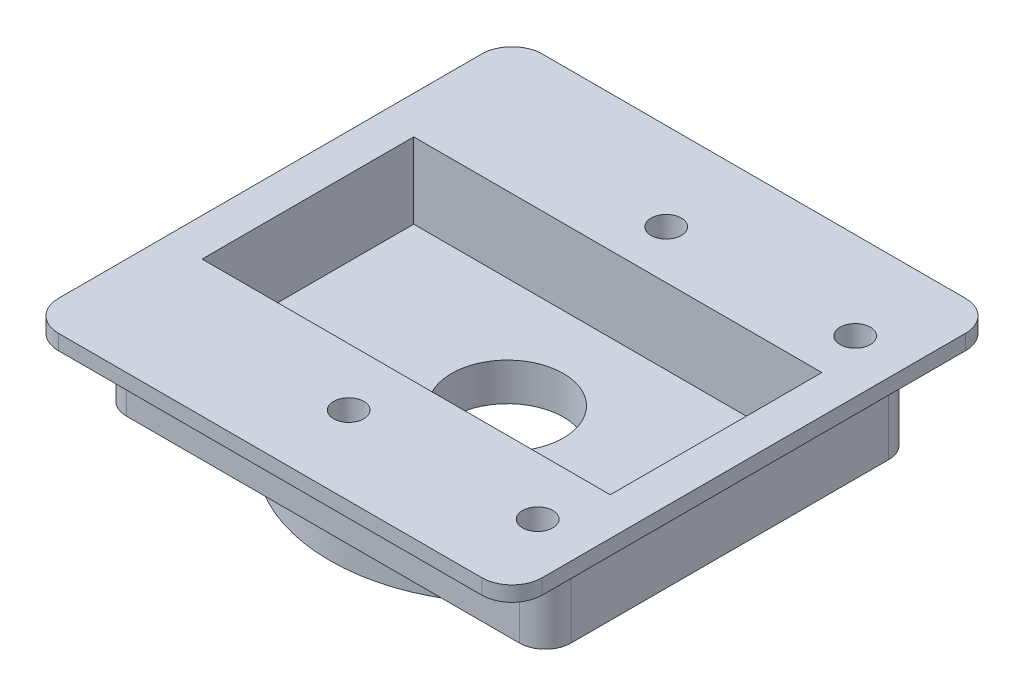
ISO-10303-21;
HEADER;
FILE_DESCRIPTION(('STEP AP214'),'2;1');
FILE_NAME('part.step','',(''),(''),'','','');
FILE_SCHEMA(('AUTOMOTIVE_DESIGN { 1 0 10303 214 1 1 1 1 }'));
ENDSEC;
DATA;
#1=APPLICATION_CONTEXT('core data for automotive mechanical design processes');
#2=APPLICATION_PROTOCOL_DEFINITION('international standard','automotive_design',2000,#1);
#3=PRODUCT_CONTEXT('',#1,'mechanical');
#4=PRODUCT('Part','Part','',(#3));
#5=PRODUCT_RELATED_PRODUCT_CATEGORY('part','',(#4));
#6=PRODUCT_DEFINITION_FORMATION('','',#4);
#7=PRODUCT_DEFINITION_CONTEXT('part definition',#1,'design');
#8=PRODUCT_DEFINITION('design','',#6,#7);
#9=PRODUCT_DEFINITION_SHAPE('','',#8);
#10=(LENGTH_UNIT() NAMED_UNIT(*) SI_UNIT(.MILLI.,.METRE.));
#11=(NAMED_UNIT(*) PLANE_ANGLE_UNIT() SI_UNIT($,.RADIAN.));
#12=(NAMED_UNIT(*) SI_UNIT($,.STERADIAN.) SOLID_ANGLE_UNIT());
#13=UNCERTAINTY_MEASURE_WITH_UNIT(LENGTH_MEASURE(1.E-05),#10,'distance_accuracy_value','');
#14=(GEOMETRIC_REPRESENTATION_CONTEXT(3) GLOBAL_UNCERTAINTY_ASSIGNED_CONTEXT((#13)) GLOBAL_UNIT_ASSIGNED_CONTEXT((#10,
#11,#12)) REPRESENTATION_CONTEXT('',''));
#15=CARTESIAN_POINT('',(0.,0.,0.));
#16=DIRECTION('',(0.,0.,1.));
#17=DIRECTION('',(1.,0.,0.));
#18=AXIS2_PLACEMENT_3D('',#15,#16,#17);
#19=CARTESIAN_POINT('',(0.,0.,0.));
#20=DIRECTION('',(0.,1.,0.));
#21=DIRECTION('',(0.,0.,1.));
#22=AXIS2_PLACEMENT_3D('',#19,#20,#21);
#23=PLANE('',#22);
#24=DIRECTION('',(0.,0.,1.));
#25=VECTOR('',#24,1.);
#26=CARTESIAN_POINT('',(-40.5526315428374,0.,2.45557808885058));
#27=LINE('',#26,#25);
#28=CARTESIAN_POINT('',(-40.5526315428374,0.,4.45557808885058));
#29=VERTEX_POINT('',#28);
#30=CARTESIAN_POINT('',(-40.5526315428374,0.,32.4555780888506));
#31=VERTEX_POINT('',#30);
#32=EDGE_CURVE('E288',#29,#31,#27,.T.);
#33=ORIENTED_EDGE('',*,*,#32,.F.);
#34=CARTESIAN_POINT('',(-38.5526315428374,0.,4.45557808885058));
#35=DIRECTION('',(0.,1.,0.));
#36=DIRECTION('',(0.,0.,1.));
#37=AXIS2_PLACEMENT_3D('',#34,#35,#36);
#38=CIRCLE('',#37,2.);
#39=CARTESIAN_POINT('',(-38.5526315428374,0.,2.45557808885058));
#40=VERTEX_POINT('',#39);
#41=EDGE_CURVE('E325',#29,#40,#38,.F.);
#42=ORIENTED_EDGE('',*,*,#41,.T.);
#43=DIRECTION('',(-1.,0.,0.));
#44=VECTOR('',#43,1.);
#45=CARTESIAN_POINT('',(-40.5526315428374,0.,2.45557808885058));
#46=LINE('',#45,#44);
#47=CARTESIAN_POINT('',(-10.5526315428374,0.,2.45557808885058));
#48=VERTEX_POINT('',#47);
#49=EDGE_CURVE('E293',#48,#40,#46,.T.);
#50=ORIENTED_EDGE('',*,*,#49,.F.);
#51=CARTESIAN_POINT('',(-10.5526315428374,0.,4.45557808885058));
#52=DIRECTION('',(0.,1.,0.));
#53=DIRECTION('',(0.,0.,1.));
#54=AXIS2_PLACEMENT_3D('',#51,#52,#53);
#55=CIRCLE('',#54,2.);
#56=CARTESIAN_POINT('',(-8.55263154283741,0.,4.45557808885058));
#57=VERTEX_POINT('',#56);
#58=EDGE_CURVE('E323',#48,#57,#55,.F.);
#59=ORIENTED_EDGE('',*,*,#58,.T.);
#60=DIRECTION('',(0.,0.,-1.));
#61=VECTOR('',#60,1.);
#62=CARTESIAN_POINT('',(-8.55263154283741,0.,2.45557808885058));
#63=LINE('',#62,#61);
#64=CARTESIAN_POINT('',(-8.55263154283741,0.,32.4555780888506));
#65=VERTEX_POINT('',#64);
#66=EDGE_CURVE('E305',#65,#57,#63,.T.);
#67=ORIENTED_EDGE('',*,*,#66,.F.);
#68=CARTESIAN_POINT('',(-10.5526315428374,0.,32.4555780888506));
#69=DIRECTION('',(0.,1.,0.));
#70=DIRECTION('',(0.,0.,1.));
#71=AXIS2_PLACEMENT_3D('',#68,#69,#70);
#72=CIRCLE('',#71,2.);
#73=CARTESIAN_POINT('',(-10.5526315428374,0.,34.4555780888506));
#74=VERTEX_POINT('',#73);
#75=EDGE_CURVE('E319',#65,#74,#72,.F.);
#76=ORIENTED_EDGE('',*,*,#75,.T.);
#77=DIRECTION('',(1.,0.,0.));
#78=VECTOR('',#77,1.);
#79=CARTESIAN_POINT('',(-40.5526315428374,0.,34.4555780888506));
#80=LINE('',#79,#78);
#81=CARTESIAN_POINT('',(-38.5526315428374,0.,34.4555780888506));
#82=VERTEX_POINT('',#81);
#83=EDGE_CURVE('E302',#82,#74,#80,.T.);
#84=ORIENTED_EDGE('',*,*,#83,.F.);
#85=CARTESIAN_POINT('',(-38.5526315428374,0.,32.4555780888506));
#86=DIRECTION('',(0.,1.,0.));
#87=DIRECTION('',(0.,0.,1.));
#88=AXIS2_PLACEMENT_3D('',#85,#86,#87);
#89=CIRCLE('',#88,2.);
#90=EDGE_CURVE('E321',#82,#31,#89,.F.);
#91=ORIENTED_EDGE('',*,*,#90,.T.);
#92=EDGE_LOOP('',(#33,#42,#50,#59,#67,#76,#84,#91));
#93=FACE_BOUND('',#92,.T.);
#94=CARTESIAN_POINT('',(-11.5526315428374,0.,29.2555780888506));
#95=DIRECTION('',(0.,-1.,0.));
#96=DIRECTION('',(0.,0.,-1.));
#97=AXIS2_PLACEMENT_3D('',#94,#95,#96);
#98=CIRCLE('',#97,1.7);
#99=CARTESIAN_POINT('',(-9.8526315428374,0.,29.2555780888506));
#100=VERTEX_POINT('',#99);
#101=CARTESIAN_POINT('',(-11.5526315428374,0.,30.9555780888506));
#102=VERTEX_POINT('',#101);
#103=EDGE_CURVE('E220',#100,#102,#98,.T.);
#104=ORIENTED_EDGE('',*,*,#103,.F.);
#105=DIRECTION('',(0.,0.,1.));
#106=VECTOR('',#105,1.);
#107=CARTESIAN_POINT('',(-9.85263154283739,0.,8.25557808885058));
#108=LINE('',#107,#106);
#109=CARTESIAN_POINT('',(-9.85263154283739,0.,8.25557808885058));
#110=VERTEX_POINT('',#109);
#111=EDGE_CURVE('E228',#110,#100,#108,.T.);
#112=ORIENTED_EDGE('',*,*,#111,.F.);
#113=CARTESIAN_POINT('',(-11.5526315428374,0.,8.25557808885058));
#114=DIRECTION('',(0.,-1.,0.));
#115=DIRECTION('',(0.,0.,-1.));
#116=AXIS2_PLACEMENT_3D('',#113,#114,#115);
#117=CIRCLE('',#116,1.7);
#118=CARTESIAN_POINT('',(-11.5526315428374,0.,6.55557808885058));
#119=VERTEX_POINT('',#118);
#120=EDGE_CURVE('E260',#119,#110,#117,.T.);
#121=ORIENTED_EDGE('',*,*,#120,.F.);
#122=DIRECTION('',(1.,0.,0.));
#123=VECTOR('',#122,1.);
#124=CARTESIAN_POINT('',(-37.5526315428374,0.,6.55557808885057));
#125=LINE('',#124,#123);
#126=CARTESIAN_POINT('',(-37.5526315428374,0.,6.55557808885057));
#127=VERTEX_POINT('',#126);
#128=EDGE_CURVE('E257',#127,#119,#125,.T.);
#129=ORIENTED_EDGE('',*,*,#128,.F.);
#130=CARTESIAN_POINT('',(-37.5526315428374,0.,8.25557808885058));
#131=DIRECTION('',(0.,-1.,0.));
#132=DIRECTION('',(0.,0.,-1.));
#133=AXIS2_PLACEMENT_3D('',#130,#131,#132);
#134=CIRCLE('',#133,1.7);
#135=CARTESIAN_POINT('',(-39.2526315428374,0.,8.25557808885058));
#136=VERTEX_POINT('',#135);
#137=EDGE_CURVE('E254',#136,#127,#134,.T.);
#138=ORIENTED_EDGE('',*,*,#137,.F.);
#139=DIRECTION('',(0.,0.,-1.));
#140=VECTOR('',#139,1.);
#141=CARTESIAN_POINT('',(-39.2526315428374,0.,29.2555780888506));
#142=LINE('',#141,#140);
#143=CARTESIAN_POINT('',(-39.2526315428374,0.,29.2555780888506));
#144=VERTEX_POINT('',#143);
#145=EDGE_CURVE('E251',#144,#136,#142,.T.);
#146=ORIENTED_EDGE('',*,*,#145,.F.);
#147=CARTESIAN_POINT('',(-37.5526315428374,0.,29.2555780888506));
#148=DIRECTION('',(0.,-1.,0.));
#149=DIRECTION('',(0.,0.,-1.));
#150=AXIS2_PLACEMENT_3D('',#147,#148,#149);
#151=CIRCLE('',#150,1.7);
#152=CARTESIAN_POINT('',(-37.5526315428374,0.,30.9555780888506));
#153=VERTEX_POINT('',#152);
#154=EDGE_CURVE('E248',#153,#144,#151,.T.);
#155=ORIENTED_EDGE('',*,*,#154,.F.);
#156=DIRECTION('',(-1.,0.,0.));
#157=VECTOR('',#156,1.);
#158=CARTESIAN_POINT('',(-11.5526315428374,0.,30.9555780888506));
#159=LINE('',#158,#157);
#160=EDGE_CURVE('E245',#102,#153,#159,.T.);
#161=ORIENTED_EDGE('',*,*,#160,.F.);
#162=EDGE_LOOP('',(#104,#112,#121,#129,#138,#146,#155,#161));
#163=FACE_BOUND('',#162,.T.);
#164=ADVANCED_FACE('F38',(#93,#163),#23,.F.);
#165=CARTESIAN_POINT('',(-40.5526315428374,1.,2.45557808885058));
#166=DIRECTION('',(1.,0.,0.));
#167=DIRECTION('',(0.,0.,-1.));
#168=AXIS2_PLACEMENT_3D('',#165,#166,#167);
#169=PLANE('',#168);
#170=DIRECTION('',(0.,0.,1.));
#171=VECTOR('',#170,1.);
#172=CARTESIAN_POINT('',(-40.5526315428374,1.,2.45557808885058));
#173=LINE('',#172,#171);
#174=CARTESIAN_POINT('',(-40.5526315428374,1.,4.45557808885058));
#175=VERTEX_POINT('',#174);
#176=CARTESIAN_POINT('',(-40.5526315428374,1.,32.4555780888506));
#177=VERTEX_POINT('',#176);
#178=EDGE_CURVE('E289',#175,#177,#173,.T.);
#179=ORIENTED_EDGE('',*,*,#178,.F.);
#180=DIRECTION('',(0.,-1.,0.));
#181=VECTOR('',#180,1.);
#182=CARTESIAN_POINT('',(-40.5526315428374,1.,4.45557808885058));
#183=LINE('',#182,#181);
#184=EDGE_CURVE('E316',#175,#29,#183,.T.);
#185=ORIENTED_EDGE('',*,*,#184,.T.);
#186=ORIENTED_EDGE('',*,*,#32,.T.);
#187=DIRECTION('',(0.,-1.,0.));
#188=VECTOR('',#187,1.);
#189=CARTESIAN_POINT('',(-40.5526315428374,1.,32.4555780888506));
#190=LINE('',#189,#188);
#191=EDGE_CURVE('E314',#31,#177,#190,.F.);
#192=ORIENTED_EDGE('',*,*,#191,.T.);
#193=EDGE_LOOP('',(#179,#185,#186,#192));
#194=FACE_BOUND('',#193,.T.);
#195=ADVANCED_FACE('F372',(#194),#169,.F.);
#196=CARTESIAN_POINT('',(-40.5526315428374,1.,34.4555780888506));
#197=DIRECTION('',(0.,0.,-1.));
#198=DIRECTION('',(-1.,0.,0.));
#199=AXIS2_PLACEMENT_3D('',#196,#197,#198);
#200=PLANE('',#199);
#201=DIRECTION('',(1.,0.,0.));
#202=VECTOR('',#201,1.);
#203=CARTESIAN_POINT('',(-40.5526315428374,1.,34.4555780888506));
#204=LINE('',#203,#202);
#205=CARTESIAN_POINT('',(-38.5526315428374,1.,34.4555780888506));
#206=VERTEX_POINT('',#205);
#207=CARTESIAN_POINT('',(-10.5526315428374,1.,34.4555780888506));
#208=VERTEX_POINT('',#207);
#209=EDGE_CURVE('E292',#206,#208,#204,.T.);
#210=ORIENTED_EDGE('',*,*,#209,.F.);
#211=DIRECTION('',(0.,-1.,0.));
#212=VECTOR('',#211,1.);
#213=CARTESIAN_POINT('',(-38.5526315428374,1.,34.4555780888506));
#214=LINE('',#213,#212);
#215=EDGE_CURVE('E11',#206,#82,#214,.T.);
#216=ORIENTED_EDGE('',*,*,#215,.T.);
#217=ORIENTED_EDGE('',*,*,#83,.T.);
#218=DIRECTION('',(0.,-1.,0.));
#219=VECTOR('',#218,1.);
#220=CARTESIAN_POINT('',(-10.5526315428374,1.,34.4555780888506));
#221=LINE('',#220,#219);
#222=EDGE_CURVE('E46',#74,#208,#221,.F.);
#223=ORIENTED_EDGE('',*,*,#222,.T.);
#224=EDGE_LOOP('',(#210,#216,#217,#223));
#225=FACE_BOUND('',#224,.T.);
#226=ADVANCED_FACE('F345',(#225),#200,.F.);
#227=CARTESIAN_POINT('',(-8.55263154283741,1.,2.45557808885058));
#228=DIRECTION('',(-1.,0.,0.));
#229=DIRECTION('',(0.,0.,1.));
#230=AXIS2_PLACEMENT_3D('',#227,#228,#229);
#231=PLANE('',#230);
#232=ORIENTED_EDGE('',*,*,#66,.T.);
#233=DIRECTION('',(0.,-1.,0.));
#234=VECTOR('',#233,1.);
#235=CARTESIAN_POINT('',(-8.55263154283741,1.,4.45557808885058));
#236=LINE('',#235,#234);
#237=CARTESIAN_POINT('',(-8.55263154283741,1.,4.45557808885058));
#238=VERTEX_POINT('',#237);
#239=EDGE_CURVE('E53',#57,#238,#236,.F.);
#240=ORIENTED_EDGE('',*,*,#239,.T.);
#241=DIRECTION('',(0.,0.,-1.));
#242=VECTOR('',#241,1.);
#243=CARTESIAN_POINT('',(-8.55263154283741,1.,2.45557808885058));
#244=LINE('',#243,#242);
#245=CARTESIAN_POINT('',(-8.55263154283741,1.,32.4555780888506));
#246=VERTEX_POINT('',#245);
#247=EDGE_CURVE('E295',#246,#238,#244,.T.);
#248=ORIENTED_EDGE('',*,*,#247,.F.);
#249=DIRECTION('',(0.,-1.,0.));
#250=VECTOR('',#249,1.);
#251=CARTESIAN_POINT('',(-8.55263154283741,1.,32.4555780888506));
#252=LINE('',#251,#250);
#253=EDGE_CURVE('E339',#246,#65,#252,.T.);
#254=ORIENTED_EDGE('',*,*,#253,.T.);
#255=EDGE_LOOP('',(#232,#240,#248,#254));
#256=FACE_BOUND('',#255,.T.);
#257=ADVANCED_FACE('F353',(#256),#231,.F.);
#258=CARTESIAN_POINT('',(-40.5526315428374,1.,2.45557808885058));
#259=DIRECTION('',(0.,0.,1.));
#260=DIRECTION('',(1.,0.,0.));
#261=AXIS2_PLACEMENT_3D('',#258,#259,#260);
#262=PLANE('',#261);
#263=ORIENTED_EDGE('',*,*,#49,.T.);
#264=DIRECTION('',(0.,-1.,0.));
#265=VECTOR('',#264,1.);
#266=CARTESIAN_POINT('',(-38.5526315428374,1.,2.45557808885058));
#267=LINE('',#266,#265);
#268=CARTESIAN_POINT('',(-38.5526315428374,1.,2.45557808885058));
#269=VERTEX_POINT('',#268);
#270=EDGE_CURVE('E330',#40,#269,#267,.F.);
#271=ORIENTED_EDGE('',*,*,#270,.T.);
#272=DIRECTION('',(-1.,0.,0.));
#273=VECTOR('',#272,1.);
#274=CARTESIAN_POINT('',(-40.5526315428374,1.,2.45557808885058));
#275=LINE('',#274,#273);
#276=CARTESIAN_POINT('',(-10.5526315428374,1.,2.45557808885058));
#277=VERTEX_POINT('',#276);
#278=EDGE_CURVE('E297',#277,#269,#275,.T.);
#279=ORIENTED_EDGE('',*,*,#278,.F.);
#280=DIRECTION('',(0.,-1.,0.));
#281=VECTOR('',#280,1.);
#282=CARTESIAN_POINT('',(-10.5526315428374,1.,2.45557808885058));
#283=LINE('',#282,#281);
#284=EDGE_CURVE('E327',#277,#48,#283,.T.);
#285=ORIENTED_EDGE('',*,*,#284,.T.);
#286=EDGE_LOOP('',(#263,#271,#279,#285));
#287=FACE_BOUND('',#286,.T.);
#288=ADVANCED_FACE('F364',(#287),#262,.F.);
#289=CARTESIAN_POINT('',(0.,1.,0.));
#290=DIRECTION('',(0.,1.,0.));
#291=DIRECTION('',(0.,0.,1.));
#292=AXIS2_PLACEMENT_3D('',#289,#290,#291);
#293=PLANE('',#292);
#294=CARTESIAN_POINT('',(-12.0526315428374,1.,8.25557808885049));
#295=DIRECTION('',(0.,1.,0.));
#296=DIRECTION('',(0.,0.,1.));
#297=AXIS2_PLACEMENT_3D('',#294,#295,#296);
#298=CIRCLE('',#297,1.);
#299=CARTESIAN_POINT('',(-12.0526315428374,1.,9.25557808885049));
#300=VERTEX_POINT('',#299);
#301=EDGE_CURVE('E505',#300,#300,#298,.T.);
#302=ORIENTED_EDGE('',*,*,#301,.F.);
#303=EDGE_LOOP('',(#302));
#304=FACE_BOUND('',#303,.T.);
#305=CARTESIAN_POINT('',(-24.5526315428373,1.,29.2555780888506));
#306=DIRECTION('',(0.,1.,0.));
#307=DIRECTION('',(0.,0.,1.));
#308=AXIS2_PLACEMENT_3D('',#305,#306,#307);
#309=CIRCLE('',#308,1.);
#310=CARTESIAN_POINT('',(-24.5526315428373,1.,30.2555780888506));
#311=VERTEX_POINT('',#310);
#312=EDGE_CURVE('E509',#311,#311,#309,.T.);
#313=ORIENTED_EDGE('',*,*,#312,.F.);
#314=EDGE_LOOP('',(#313));
#315=FACE_BOUND('',#314,.T.);
#316=CARTESIAN_POINT('',(-12.0526315428373,1.,29.2555780888505));
#317=DIRECTION('',(0.,1.,0.));
#318=DIRECTION('',(0.,0.,1.));
#319=AXIS2_PLACEMENT_3D('',#316,#317,#318);
#320=CIRCLE('',#319,1.);
#321=CARTESIAN_POINT('',(-12.0526315428373,1.,30.2555780888505));
#322=VERTEX_POINT('',#321);
#323=EDGE_CURVE('E513',#322,#322,#320,.T.);
#324=ORIENTED_EDGE('',*,*,#323,.F.);
#325=EDGE_LOOP('',(#324));
#326=FACE_BOUND('',#325,.T.);
#327=CARTESIAN_POINT('',(-24.5526315428374,1.,8.25557808885058));
#328=DIRECTION('',(0.,1.,0.));
#329=DIRECTION('',(0.,0.,1.));
#330=AXIS2_PLACEMENT_3D('',#327,#328,#329);
#331=CIRCLE('',#330,1.);
#332=CARTESIAN_POINT('',(-24.5526315428374,1.,9.25557808885058));
#333=VERTEX_POINT('',#332);
#334=EDGE_CURVE('E517',#333,#333,#331,.T.);
#335=ORIENTED_EDGE('',*,*,#334,.F.);
#336=EDGE_LOOP('',(#335));
#337=FACE_BOUND('',#336,.T.);
#338=DIRECTION('',(0.,0.,-1.));
#339=VECTOR('',#338,1.);
#340=CARTESIAN_POINT('',(-11.0526315428374,1.,11.4555780888506));
#341=LINE('',#340,#339);
#342=CARTESIAN_POINT('',(-11.0526315428374,1.,25.4555780888506));
#343=VERTEX_POINT('',#342);
#344=CARTESIAN_POINT('',(-11.0526315428374,1.,11.4555780888506));
#345=VERTEX_POINT('',#344);
#346=EDGE_CURVE('E184',#343,#345,#341,.T.);
#347=ORIENTED_EDGE('',*,*,#346,.F.);
#348=DIRECTION('',(1.,0.,0.));
#349=VECTOR('',#348,1.);
#350=CARTESIAN_POINT('',(-11.0526315428374,1.,25.4555780888506));
#351=LINE('',#350,#349);
#352=CARTESIAN_POINT('',(-38.0526315428374,1.,25.4555780888506));
#353=VERTEX_POINT('',#352);
#354=EDGE_CURVE('E201',#353,#343,#351,.T.);
#355=ORIENTED_EDGE('',*,*,#354,.F.);
#356=DIRECTION('',(0.,0.,1.));
#357=VECTOR('',#356,1.);
#358=CARTESIAN_POINT('',(-38.0526315428374,1.,11.4555780888506));
#359=LINE('',#358,#357);
#360=CARTESIAN_POINT('',(-38.0526315428374,1.,11.4555780888506));
#361=VERTEX_POINT('',#360);
#362=EDGE_CURVE('E204',#361,#353,#359,.T.);
#363=ORIENTED_EDGE('',*,*,#362,.F.);
#364=DIRECTION('',(-1.,0.,0.));
#365=VECTOR('',#364,1.);
#366=CARTESIAN_POINT('',(-11.0526315428374,1.,11.4555780888506));
#367=LINE('',#366,#365);
#368=EDGE_CURVE('E213',#345,#361,#367,.T.);
#369=ORIENTED_EDGE('',*,*,#368,.F.);
#370=EDGE_LOOP('',(#347,#355,#363,#369));
#371=FACE_BOUND('',#370,.T.);
#372=ORIENTED_EDGE('',*,*,#278,.T.);
#373=CARTESIAN_POINT('',(-38.5526315428374,1.,4.45557808885058));
#374=DIRECTION('',(0.,1.,0.));
#375=DIRECTION('',(0.,0.,1.));
#376=AXIS2_PLACEMENT_3D('',#373,#374,#375);
#377=CIRCLE('',#376,2.);
#378=EDGE_CURVE('E337',#269,#175,#377,.T.);
#379=ORIENTED_EDGE('',*,*,#378,.T.);
#380=ORIENTED_EDGE('',*,*,#178,.T.);
#381=CARTESIAN_POINT('',(-38.5526315428374,1.,32.4555780888506));
#382=DIRECTION('',(0.,1.,0.));
#383=DIRECTION('',(0.,0.,1.));
#384=AXIS2_PLACEMENT_3D('',#381,#382,#383);
#385=CIRCLE('',#384,2.);
#386=EDGE_CURVE('E333',#177,#206,#385,.T.);
#387=ORIENTED_EDGE('',*,*,#386,.T.);
#388=ORIENTED_EDGE('',*,*,#209,.T.);
#389=CARTESIAN_POINT('',(-10.5526315428374,1.,32.4555780888506));
#390=DIRECTION('',(0.,1.,0.));
#391=DIRECTION('',(0.,0.,1.));
#392=AXIS2_PLACEMENT_3D('',#389,#390,#391);
#393=CIRCLE('',#392,2.);
#394=EDGE_CURVE('E60',#208,#246,#393,.T.);
#395=ORIENTED_EDGE('',*,*,#394,.T.);
#396=ORIENTED_EDGE('',*,*,#247,.T.);
#397=CARTESIAN_POINT('',(-10.5526315428374,1.,4.45557808885058));
#398=DIRECTION('',(0.,1.,0.));
#399=DIRECTION('',(0.,0.,1.));
#400=AXIS2_PLACEMENT_3D('',#397,#398,#399);
#401=CIRCLE('',#400,2.);
#402=EDGE_CURVE('E335',#238,#277,#401,.T.);
#403=ORIENTED_EDGE('',*,*,#402,.T.);
#404=EDGE_LOOP('',(#372,#379,#380,#387,#388,#395,#396,#403));
#405=FACE_BOUND('',#404,.T.);
#406=ADVANCED_FACE('F349',(#304,#315,#326,#337,#371,#405),#293,.T.);
#407=CARTESIAN_POINT('',(-11.5526315428374,-5.,29.2555780888506));
#408=DIRECTION('',(0.,1.,0.));
#409=DIRECTION('',(0.,0.,1.));
#410=AXIS2_PLACEMENT_3D('',#407,#408,#409);
#411=CYLINDRICAL_SURFACE('',#410,1.7);
#412=ORIENTED_EDGE('',*,*,#103,.T.);
#413=DIRECTION('',(0.,1.,0.));
#414=VECTOR('',#413,1.);
#415=CARTESIAN_POINT('',(-11.5526315428374,-5.,30.9555780888506));
#416=LINE('',#415,#414);
#417=CARTESIAN_POINT('',(-11.5526315428374,-5.,30.9555780888506));
#418=VERTEX_POINT('',#417);
#419=EDGE_CURVE('E285',#418,#102,#416,.T.);
#420=ORIENTED_EDGE('',*,*,#419,.F.);
#421=CARTESIAN_POINT('',(-11.5526315428374,-5.,29.2555780888506));
#422=DIRECTION('',(0.,-1.,0.));
#423=DIRECTION('',(0.,0.,-1.));
#424=AXIS2_PLACEMENT_3D('',#421,#422,#423);
#425=CIRCLE('',#424,1.7);
#426=CARTESIAN_POINT('',(-9.8526315428374,-5.,29.2555780888506));
#427=VERTEX_POINT('',#426);
#428=EDGE_CURVE('E224',#427,#418,#425,.T.);
#429=ORIENTED_EDGE('',*,*,#428,.F.);
#430=DIRECTION('',(0.,1.,0.));
#431=VECTOR('',#430,1.);
#432=CARTESIAN_POINT('',(-9.8526315428374,-5.,29.2555780888506));
#433=LINE('',#432,#431);
#434=EDGE_CURVE('E242',#427,#100,#433,.T.);
#435=ORIENTED_EDGE('',*,*,#434,.T.);
#436=EDGE_LOOP('',(#412,#420,#429,#435));
#437=FACE_BOUND('',#436,.T.);
#438=ADVANCED_FACE('F473',(#437),#411,.T.);
#439=CARTESIAN_POINT('',(-11.5526315428374,-5.,30.9555780888506));
#440=DIRECTION('',(0.,0.,-1.));
#441=DIRECTION('',(-1.,0.,0.));
#442=AXIS2_PLACEMENT_3D('',#439,#440,#441);
#443=PLANE('',#442);
#444=ORIENTED_EDGE('',*,*,#160,.T.);
#445=DIRECTION('',(0.,1.,0.));
#446=VECTOR('',#445,1.);
#447=CARTESIAN_POINT('',(-37.5526315428374,-5.,30.9555780888506));
#448=LINE('',#447,#446);
#449=CARTESIAN_POINT('',(-37.5526315428374,-5.,30.9555780888506));
#450=VERTEX_POINT('',#449);
#451=EDGE_CURVE('E282',#450,#153,#448,.T.);
#452=ORIENTED_EDGE('',*,*,#451,.F.);
#453=DIRECTION('',(-1.,0.,0.));
#454=VECTOR('',#453,1.);
#455=CARTESIAN_POINT('',(-11.5526315428374,-5.,30.9555780888506));
#456=LINE('',#455,#454);
#457=EDGE_CURVE('E227',#418,#450,#456,.T.);
#458=ORIENTED_EDGE('',*,*,#457,.F.);
#459=ORIENTED_EDGE('',*,*,#419,.T.);
#460=EDGE_LOOP('',(#444,#452,#458,#459));
#461=FACE_BOUND('',#460,.T.);
#462=ADVANCED_FACE('F470',(#461),#443,.F.);
#463=CARTESIAN_POINT('',(-37.5526315428374,-5.,29.2555780888506));
#464=DIRECTION('',(0.,1.,0.));
#465=DIRECTION('',(0.,0.,1.));
#466=AXIS2_PLACEMENT_3D('',#463,#464,#465);
#467=CYLINDRICAL_SURFACE('',#466,1.7);
#468=ORIENTED_EDGE('',*,*,#154,.T.);
#469=DIRECTION('',(0.,1.,0.));
#470=VECTOR('',#469,1.);
#471=CARTESIAN_POINT('',(-39.2526315428374,-5.,29.2555780888506));
#472=LINE('',#471,#470);
#473=CARTESIAN_POINT('',(-39.2526315428374,-5.,29.2555780888506));
#474=VERTEX_POINT('',#473);
#475=EDGE_CURVE('E279',#474,#144,#472,.T.);
#476=ORIENTED_EDGE('',*,*,#475,.F.);
#477=CARTESIAN_POINT('',(-37.5526315428374,-5.,29.2555780888506));
#478=DIRECTION('',(0.,-1.,0.));
#479=DIRECTION('',(0.,0.,-1.));
#480=AXIS2_PLACEMENT_3D('',#477,#478,#479);
#481=CIRCLE('',#480,1.7);
#482=EDGE_CURVE('E230',#450,#474,#481,.T.);
#483=ORIENTED_EDGE('',*,*,#482,.F.);
#484=ORIENTED_EDGE('',*,*,#451,.T.);
#485=EDGE_LOOP('',(#468,#476,#483,#484));
#486=FACE_BOUND('',#485,.T.);
#487=ADVANCED_FACE('F466',(#486),#467,.T.);
#488=CARTESIAN_POINT('',(-39.2526315428374,-5.,29.2555780888506));
#489=DIRECTION('',(1.,0.,0.));
#490=DIRECTION('',(0.,0.,-1.));
#491=AXIS2_PLACEMENT_3D('',#488,#489,#490);
#492=PLANE('',#491);
#493=ORIENTED_EDGE('',*,*,#145,.T.);
#494=DIRECTION('',(0.,1.,0.));
#495=VECTOR('',#494,1.);
#496=CARTESIAN_POINT('',(-39.2526315428374,-5.,8.25557808885058));
#497=LINE('',#496,#495);
#498=CARTESIAN_POINT('',(-39.2526315428374,-5.,8.25557808885058));
#499=VERTEX_POINT('',#498);
#500=EDGE_CURVE('E276',#499,#136,#497,.T.);
#501=ORIENTED_EDGE('',*,*,#500,.F.);
#502=DIRECTION('',(0.,0.,-1.));
#503=VECTOR('',#502,1.);
#504=CARTESIAN_POINT('',(-39.2526315428374,-5.,29.2555780888506));
#505=LINE('',#504,#503);
#506=EDGE_CURVE('E232',#474,#499,#505,.T.);
#507=ORIENTED_EDGE('',*,*,#506,.F.);
#508=ORIENTED_EDGE('',*,*,#475,.T.);
#509=EDGE_LOOP('',(#493,#501,#507,#508));
#510=FACE_BOUND('',#509,.T.);
#511=ADVANCED_FACE('F462',(#510),#492,.F.);
#512=CARTESIAN_POINT('',(-37.5526315428374,-5.,8.25557808885058));
#513=DIRECTION('',(0.,1.,0.));
#514=DIRECTION('',(0.,0.,1.));
#515=AXIS2_PLACEMENT_3D('',#512,#513,#514);
#516=CYLINDRICAL_SURFACE('',#515,1.7);
#517=ORIENTED_EDGE('',*,*,#137,.T.);
#518=DIRECTION('',(0.,1.,0.));
#519=VECTOR('',#518,1.);
#520=CARTESIAN_POINT('',(-37.5526315428374,-5.,6.55557808885057));
#521=LINE('',#520,#519);
#522=CARTESIAN_POINT('',(-37.5526315428374,-5.,6.55557808885057));
#523=VERTEX_POINT('',#522);
#524=EDGE_CURVE('E273',#523,#127,#521,.T.);
#525=ORIENTED_EDGE('',*,*,#524,.F.);
#526=CARTESIAN_POINT('',(-37.5526315428374,-5.,8.25557808885058));
#527=DIRECTION('',(0.,-1.,0.));
#528=DIRECTION('',(0.,0.,-1.));
#529=AXIS2_PLACEMENT_3D('',#526,#527,#528);
#530=CIRCLE('',#529,1.7);
#531=EDGE_CURVE('E234',#499,#523,#530,.T.);
#532=ORIENTED_EDGE('',*,*,#531,.F.);
#533=ORIENTED_EDGE('',*,*,#500,.T.);
#534=EDGE_LOOP('',(#517,#525,#532,#533));
#535=FACE_BOUND('',#534,.T.);
#536=ADVANCED_FACE('F458',(#535),#516,.T.);
#537=CARTESIAN_POINT('',(-37.5526315428374,-5.,6.55557808885057));
#538=DIRECTION('',(0.,0.,1.));
#539=DIRECTION('',(1.,0.,0.));
#540=AXIS2_PLACEMENT_3D('',#537,#538,#539);
#541=PLANE('',#540);
#542=ORIENTED_EDGE('',*,*,#128,.T.);
#543=DIRECTION('',(0.,1.,0.));
#544=VECTOR('',#543,1.);
#545=CARTESIAN_POINT('',(-11.5526315428374,-5.,6.55557808885058));
#546=LINE('',#545,#544);
#547=CARTESIAN_POINT('',(-11.5526315428374,-5.,6.55557808885058));
#548=VERTEX_POINT('',#547);
#549=EDGE_CURVE('E270',#548,#119,#546,.T.);
#550=ORIENTED_EDGE('',*,*,#549,.F.);
#551=DIRECTION('',(1.,0.,0.));
#552=VECTOR('',#551,1.);
#553=CARTESIAN_POINT('',(-37.5526315428374,-5.,6.55557808885057));
#554=LINE('',#553,#552);
#555=EDGE_CURVE('E236',#523,#548,#554,.T.);
#556=ORIENTED_EDGE('',*,*,#555,.F.);
#557=ORIENTED_EDGE('',*,*,#524,.T.);
#558=EDGE_LOOP('',(#542,#550,#556,#557));
#559=FACE_BOUND('',#558,.T.);
#560=ADVANCED_FACE('F454',(#559),#541,.F.);
#561=CARTESIAN_POINT('',(-11.5526315428374,-5.,8.25557808885058));
#562=DIRECTION('',(0.,1.,0.));
#563=DIRECTION('',(0.,0.,1.));
#564=AXIS2_PLACEMENT_3D('',#561,#562,#563);
#565=CYLINDRICAL_SURFACE('',#564,1.7);
#566=ORIENTED_EDGE('',*,*,#120,.T.);
#567=DIRECTION('',(0.,1.,0.));
#568=VECTOR('',#567,1.);
#569=CARTESIAN_POINT('',(-9.85263154283739,-5.,8.25557808885058));
#570=LINE('',#569,#568);
#571=CARTESIAN_POINT('',(-9.85263154283739,-5.,8.25557808885058));
#572=VERTEX_POINT('',#571);
#573=EDGE_CURVE('E267',#572,#110,#570,.T.);
#574=ORIENTED_EDGE('',*,*,#573,.F.);
#575=CARTESIAN_POINT('',(-11.5526315428374,-5.,8.25557808885058));
#576=DIRECTION('',(0.,-1.,0.));
#577=DIRECTION('',(0.,0.,-1.));
#578=AXIS2_PLACEMENT_3D('',#575,#576,#577);
#579=CIRCLE('',#578,1.7);
#580=EDGE_CURVE('E238',#548,#572,#579,.T.);
#581=ORIENTED_EDGE('',*,*,#580,.F.);
#582=ORIENTED_EDGE('',*,*,#549,.T.);
#583=EDGE_LOOP('',(#566,#574,#581,#582));
#584=FACE_BOUND('',#583,.T.);
#585=ADVANCED_FACE('F450',(#584),#565,.T.);
#586=CARTESIAN_POINT('',(-9.85263154283739,-5.,8.25557808885058));
#587=DIRECTION('',(-1.,0.,0.));
#588=DIRECTION('',(0.,0.,1.));
#589=AXIS2_PLACEMENT_3D('',#586,#587,#588);
#590=PLANE('',#589);
#591=ORIENTED_EDGE('',*,*,#111,.T.);
#592=ORIENTED_EDGE('',*,*,#434,.F.);
#593=DIRECTION('',(0.,0.,1.));
#594=VECTOR('',#593,1.);
#595=CARTESIAN_POINT('',(-9.85263154283739,-5.,8.25557808885058));
#596=LINE('',#595,#594);
#597=EDGE_CURVE('E240',#572,#427,#596,.T.);
#598=ORIENTED_EDGE('',*,*,#597,.F.);
#599=ORIENTED_EDGE('',*,*,#573,.T.);
#600=EDGE_LOOP('',(#591,#592,#598,#599));
#601=FACE_BOUND('',#600,.T.);
#602=ADVANCED_FACE('F446',(#601),#590,.F.);
#603=CARTESIAN_POINT('',(-11.5526315428374,-5.,29.2555780888506));
#604=DIRECTION('',(0.,-1.,0.));
#605=DIRECTION('',(0.,0.,-1.));
#606=AXIS2_PLACEMENT_3D('',#603,#604,#605);
#607=PLANE('',#606);
#608=CARTESIAN_POINT('',(-24.5526315428374,-5.,18.7555780888506));
#609=DIRECTION('',(0.,-1.,0.));
#610=DIRECTION('',(0.,0.,-1.));
#611=AXIS2_PLACEMENT_3D('',#608,#609,#610);
#612=CIRCLE('',#611,11.7476249971324);
#613=CARTESIAN_POINT('',(-24.5526315428374,-5.,7.00795309171819));
#614=VERTEX_POINT('',#613);
#615=EDGE_CURVE('E207',#614,#614,#612,.T.);
#616=ORIENTED_EDGE('',*,*,#615,.F.);
#617=EDGE_LOOP('',(#616));
#618=FACE_BOUND('',#617,.T.);
#619=ORIENTED_EDGE('',*,*,#428,.T.);
#620=ORIENTED_EDGE('',*,*,#457,.T.);
#621=ORIENTED_EDGE('',*,*,#482,.T.);
#622=ORIENTED_EDGE('',*,*,#506,.T.);
#623=ORIENTED_EDGE('',*,*,#531,.T.);
#624=ORIENTED_EDGE('',*,*,#555,.T.);
#625=ORIENTED_EDGE('',*,*,#580,.T.);
#626=ORIENTED_EDGE('',*,*,#597,.T.);
#627=EDGE_LOOP('',(#619,#620,#621,#622,#623,#624,#625,#626));
#628=FACE_BOUND('',#627,.T.);
#629=ADVANCED_FACE('F443',(#618,#628),#607,.T.);
#630=CARTESIAN_POINT('',(-11.0526315428374,-4.,11.4555780888506));
#631=DIRECTION('',(1.,0.,0.));
#632=DIRECTION('',(0.,0.,-1.));
#633=AXIS2_PLACEMENT_3D('',#630,#631,#632);
#634=PLANE('',#633);
#635=ORIENTED_EDGE('',*,*,#346,.T.);
#636=DIRECTION('',(0.,1.,0.));
#637=VECTOR('',#636,1.);
#638=CARTESIAN_POINT('',(-11.0526315428374,-4.,11.4555780888506));
#639=LINE('',#638,#637);
#640=CARTESIAN_POINT('',(-11.0526315428374,-4.,11.4555780888506));
#641=VERTEX_POINT('',#640);
#642=EDGE_CURVE('E177',#641,#345,#639,.T.);
#643=ORIENTED_EDGE('',*,*,#642,.F.);
#644=DIRECTION('',(0.,0.,-1.));
#645=VECTOR('',#644,1.);
#646=CARTESIAN_POINT('',(-11.0526315428374,-4.,11.4555780888506));
#647=LINE('',#646,#645);
#648=CARTESIAN_POINT('',(-11.0526315428374,-4.,25.4555780888506));
#649=VERTEX_POINT('',#648);
#650=EDGE_CURVE('E181',#649,#641,#647,.T.);
#651=ORIENTED_EDGE('',*,*,#650,.F.);
#652=DIRECTION('',(0.,1.,0.));
#653=VECTOR('',#652,1.);
#654=CARTESIAN_POINT('',(-11.0526315428374,-4.,25.4555780888506));
#655=LINE('',#654,#653);
#656=EDGE_CURVE('E218',#649,#343,#655,.T.);
#657=ORIENTED_EDGE('',*,*,#656,.T.);
#658=EDGE_LOOP('',(#635,#643,#651,#657));
#659=FACE_BOUND('',#658,.T.);
#660=ADVANCED_FACE('F179',(#659),#634,.F.);
#661=CARTESIAN_POINT('',(-11.0526315428374,-4.,25.4555780888506));
#662=DIRECTION('',(0.,0.,1.));
#663=DIRECTION('',(1.,0.,0.));
#664=AXIS2_PLACEMENT_3D('',#661,#662,#663);
#665=PLANE('',#664);
#666=ORIENTED_EDGE('',*,*,#354,.T.);
#667=ORIENTED_EDGE('',*,*,#656,.F.);
#668=DIRECTION('',(1.,0.,0.));
#669=VECTOR('',#668,1.);
#670=CARTESIAN_POINT('',(-11.0526315428374,-4.,25.4555780888506));
#671=LINE('',#670,#669);
#672=CARTESIAN_POINT('',(-38.0526315428374,-4.,25.4555780888506));
#673=VERTEX_POINT('',#672);
#674=EDGE_CURVE('E189',#673,#649,#671,.T.);
#675=ORIENTED_EDGE('',*,*,#674,.F.);
#676=DIRECTION('',(0.,1.,0.));
#677=VECTOR('',#676,1.);
#678=CARTESIAN_POINT('',(-38.0526315428374,-4.,25.4555780888506));
#679=LINE('',#678,#677);
#680=EDGE_CURVE('E221',#673,#353,#679,.T.);
#681=ORIENTED_EDGE('',*,*,#680,.T.);
#682=EDGE_LOOP('',(#666,#667,#675,#681));
#683=FACE_BOUND('',#682,.T.);
#684=ADVANCED_FACE('F431',(#683),#665,.F.);
#685=CARTESIAN_POINT('',(-38.0526315428374,-4.,11.4555780888506));
#686=DIRECTION('',(-1.,0.,0.));
#687=DIRECTION('',(0.,0.,1.));
#688=AXIS2_PLACEMENT_3D('',#685,#686,#687);
#689=PLANE('',#688);
#690=ORIENTED_EDGE('',*,*,#362,.T.);
#691=ORIENTED_EDGE('',*,*,#680,.F.);
#692=DIRECTION('',(0.,0.,1.));
#693=VECTOR('',#692,1.);
#694=CARTESIAN_POINT('',(-38.0526315428374,-4.,11.4555780888506));
#695=LINE('',#694,#693);
#696=CARTESIAN_POINT('',(-38.0526315428374,-4.,11.4555780888506));
#697=VERTEX_POINT('',#696);
#698=EDGE_CURVE('E197',#697,#673,#695,.T.);
#699=ORIENTED_EDGE('',*,*,#698,.F.);
#700=DIRECTION('',(0.,1.,0.));
#701=VECTOR('',#700,1.);
#702=CARTESIAN_POINT('',(-38.0526315428374,-4.,11.4555780888506));
#703=LINE('',#702,#701);
#704=EDGE_CURVE('E188',#697,#361,#703,.T.);
#705=ORIENTED_EDGE('',*,*,#704,.T.);
#706=EDGE_LOOP('',(#690,#691,#699,#705));
#707=FACE_BOUND('',#706,.T.);
#708=ADVANCED_FACE('F434',(#707),#689,.F.);
#709=CARTESIAN_POINT('',(-11.0526315428374,-4.,11.4555780888506));
#710=DIRECTION('',(0.,0.,-1.));
#711=DIRECTION('',(-1.,0.,0.));
#712=AXIS2_PLACEMENT_3D('',#709,#710,#711);
#713=PLANE('',#712);
#714=ORIENTED_EDGE('',*,*,#368,.T.);
#715=ORIENTED_EDGE('',*,*,#704,.F.);
#716=DIRECTION('',(-1.,0.,0.));
#717=VECTOR('',#716,1.);
#718=CARTESIAN_POINT('',(-11.0526315428374,-4.,11.4555780888506));
#719=LINE('',#718,#717);
#720=EDGE_CURVE('E192',#641,#697,#719,.T.);
#721=ORIENTED_EDGE('',*,*,#720,.F.);
#722=ORIENTED_EDGE('',*,*,#642,.T.);
#723=EDGE_LOOP('',(#714,#715,#721,#722));
#724=FACE_BOUND('',#723,.T.);
#725=ADVANCED_FACE('F193',(#724),#713,.F.);
#726=CARTESIAN_POINT('',(0.,-4.,0.));
#727=DIRECTION('',(0.,-1.,0.));
#728=DIRECTION('',(0.,0.,-1.));
#729=AXIS2_PLACEMENT_3D('',#726,#727,#728);
#730=PLANE('',#729);
#731=CARTESIAN_POINT('',(-24.5526315428374,-4.,18.7555780888506));
#732=DIRECTION('',(0.,-1.,0.));
#733=DIRECTION('',(0.,0.,-1.));
#734=AXIS2_PLACEMENT_3D('',#731,#732,#733);
#735=CIRCLE('',#734,3.7);
#736=CARTESIAN_POINT('',(-24.5526315428374,-4.,15.0555780888506));
#737=VERTEX_POINT('',#736);
#738=EDGE_CURVE('E309',#737,#737,#735,.T.);
#739=ORIENTED_EDGE('',*,*,#738,.T.);
#740=EDGE_LOOP('',(#739));
#741=FACE_BOUND('',#740,.T.);
#742=ORIENTED_EDGE('',*,*,#650,.T.);
#743=ORIENTED_EDGE('',*,*,#720,.T.);
#744=ORIENTED_EDGE('',*,*,#698,.T.);
#745=ORIENTED_EDGE('',*,*,#674,.T.);
#746=EDGE_LOOP('',(#742,#743,#744,#745));
#747=FACE_BOUND('',#746,.T.);
#748=ADVANCED_FACE('F199',(#741,#747),#730,.F.);
#749=CARTESIAN_POINT('',(-24.5526315428374,-7.,18.7555780888506));
#750=DIRECTION('',(0.,1.,0.));
#751=DIRECTION('',(0.,0.,1.));
#752=AXIS2_PLACEMENT_3D('',#749,#750,#751);
#753=CYLINDRICAL_SURFACE('',#752,11.7476249971324);
#754=CARTESIAN_POINT('',(-24.5526315428374,-7.,18.7555780888506));
#755=DIRECTION('',(0.,-1.,0.));
#756=DIRECTION('',(0.,0.,-1.));
#757=AXIS2_PLACEMENT_3D('',#754,#755,#756);
#758=CIRCLE('',#757,11.7476249971324);
#759=CARTESIAN_POINT('',(-24.5526315428374,-7.,7.00795309171819));
#760=VERTEX_POINT('',#759);
#761=EDGE_CURVE('E214',#760,#760,#758,.T.);
#762=ORIENTED_EDGE('',*,*,#761,.F.);
#763=EDGE_LOOP('',(#762));
#764=FACE_BOUND('',#763,.T.);
#765=ORIENTED_EDGE('',*,*,#615,.T.);
#766=EDGE_LOOP('',(#765));
#767=FACE_BOUND('',#766,.T.);
#768=ADVANCED_FACE('F423',(#764,#767),#753,.T.);
#769=CARTESIAN_POINT('',(-24.5526315428374,-7.,18.7555780888506));
#770=DIRECTION('',(0.,-1.,0.));
#771=DIRECTION('',(0.,0.,-1.));
#772=AXIS2_PLACEMENT_3D('',#769,#770,#771);
#773=PLANE('',#772);
#774=CARTESIAN_POINT('',(-24.5526315428374,-7.,18.7555780888506));
#775=DIRECTION('',(0.,-1.,0.));
#776=DIRECTION('',(0.,0.,-1.));
#777=AXIS2_PLACEMENT_3D('',#774,#775,#776);
#778=CIRCLE('',#777,4.75);
#779=CARTESIAN_POINT('',(-24.5526315428374,-7.,14.0055780888506));
#780=VERTEX_POINT('',#779);
#781=EDGE_CURVE('E312',#780,#780,#778,.T.);
#782=ORIENTED_EDGE('',*,*,#781,.F.);
#783=EDGE_LOOP('',(#782));
#784=FACE_BOUND('',#783,.T.);
#785=ORIENTED_EDGE('',*,*,#761,.T.);
#786=EDGE_LOOP('',(#785));
#787=FACE_BOUND('',#786,.T.);
#788=ADVANCED_FACE('F419',(#784,#787),#773,.T.);
#789=CARTESIAN_POINT('',(-24.5526315428374,-7.,18.7555780888506));
#790=DIRECTION('',(0.,-1.,0.));
#791=DIRECTION('',(0.,0.,-1.));
#792=AXIS2_PLACEMENT_3D('',#789,#790,#791);
#793=CONICAL_SURFACE('',#792,4.75,0.645771823237902);
#794=CARTESIAN_POINT('',(-24.5526315428374,-6.5,18.7555780888506));
#795=DIRECTION('',(0.,-1.,0.));
#796=DIRECTION('',(0.,0.,-1.));
#797=AXIS2_PLACEMENT_3D('',#794,#795,#796);
#798=CIRCLE('',#797,4.3732229749486);
#799=CARTESIAN_POINT('',(-24.5526315428374,-6.5,14.382355113902));
#800=VERTEX_POINT('',#799);
#801=EDGE_CURVE('E533',#800,#800,#798,.T.);
#802=ORIENTED_EDGE('',*,*,#801,.F.);
#803=EDGE_LOOP('',(#802));
#804=FACE_BOUND('',#803,.T.);
#805=ORIENTED_EDGE('',*,*,#781,.T.);
#806=EDGE_LOOP('',(#805));
#807=FACE_BOUND('',#806,.T.);
#808=ADVANCED_FACE('F409',(#804,#807),#793,.F.);
#809=CARTESIAN_POINT('',(-24.5526315428374,-6.5,18.7555780888506));
#810=DIRECTION('',(0.,-1.,0.));
#811=DIRECTION('',(0.,0.,-1.));
#812=AXIS2_PLACEMENT_3D('',#809,#810,#811);
#813=PLANE('',#812);
#814=CARTESIAN_POINT('',(-24.5526315428374,-6.5,18.7555780888506));
#815=DIRECTION('',(0.,-1.,0.));
#816=DIRECTION('',(0.,0.,-1.));
#817=AXIS2_PLACEMENT_3D('',#814,#815,#816);
#818=CIRCLE('',#817,3.7);
#819=CARTESIAN_POINT('',(-24.5526315428374,-6.5,15.0555780888506));
#820=VERTEX_POINT('',#819);
#821=EDGE_CURVE('E313',#820,#820,#818,.T.);
#822=ORIENTED_EDGE('',*,*,#821,.F.);
#823=EDGE_LOOP('',(#822));
#824=FACE_BOUND('',#823,.T.);
#825=ORIENTED_EDGE('',*,*,#801,.T.);
#826=EDGE_LOOP('',(#825));
#827=FACE_BOUND('',#826,.T.);
#828=ADVANCED_FACE('F404',(#824,#827),#813,.T.);
#829=CARTESIAN_POINT('',(-24.5526315428374,1.,18.7555780888506));
#830=DIRECTION('',(0.,-1.,0.));
#831=DIRECTION('',(0.,0.,-1.));
#832=AXIS2_PLACEMENT_3D('',#829,#830,#831);
#833=CYLINDRICAL_SURFACE('',#832,3.7);
#834=ORIENTED_EDGE('',*,*,#821,.T.);
#835=EDGE_LOOP('',(#834));
#836=FACE_BOUND('',#835,.T.);
#837=ORIENTED_EDGE('',*,*,#738,.F.);
#838=EDGE_LOOP('',(#837));
#839=FACE_BOUND('',#838,.T.);
#840=ADVANCED_FACE('F400',(#836,#839),#833,.F.);
#841=CARTESIAN_POINT('',(-38.5526315428374,1.,4.45557808885058));
#842=DIRECTION('',(0.,-1.,0.));
#843=DIRECTION('',(0.,0.,-1.));
#844=AXIS2_PLACEMENT_3D('',#841,#842,#843);
#845=CYLINDRICAL_SURFACE('',#844,2.);
#846=ORIENTED_EDGE('',*,*,#378,.F.);
#847=ORIENTED_EDGE('',*,*,#270,.F.);
#848=ORIENTED_EDGE('',*,*,#41,.F.);
#849=ORIENTED_EDGE('',*,*,#184,.F.);
#850=EDGE_LOOP('',(#846,#847,#848,#849));
#851=FACE_BOUND('',#850,.T.);
#852=ADVANCED_FACE('F370',(#851),#845,.T.);
#853=CARTESIAN_POINT('',(-10.5526315428374,1.,4.45557808885058));
#854=DIRECTION('',(0.,-1.,0.));
#855=DIRECTION('',(0.,0.,-1.));
#856=AXIS2_PLACEMENT_3D('',#853,#854,#855);
#857=CYLINDRICAL_SURFACE('',#856,2.);
#858=ORIENTED_EDGE('',*,*,#402,.F.);
#859=ORIENTED_EDGE('',*,*,#239,.F.);
#860=ORIENTED_EDGE('',*,*,#58,.F.);
#861=ORIENTED_EDGE('',*,*,#284,.F.);
#862=EDGE_LOOP('',(#858,#859,#860,#861));
#863=FACE_BOUND('',#862,.T.);
#864=ADVANCED_FACE('F361',(#863),#857,.T.);
#865=CARTESIAN_POINT('',(-38.5526315428374,1.,32.4555780888506));
#866=DIRECTION('',(0.,-1.,0.));
#867=DIRECTION('',(0.,0.,-1.));
#868=AXIS2_PLACEMENT_3D('',#865,#866,#867);
#869=CYLINDRICAL_SURFACE('',#868,2.);
#870=ORIENTED_EDGE('',*,*,#386,.F.);
#871=ORIENTED_EDGE('',*,*,#191,.F.);
#872=ORIENTED_EDGE('',*,*,#90,.F.);
#873=ORIENTED_EDGE('',*,*,#215,.F.);
#874=EDGE_LOOP('',(#870,#871,#872,#873));
#875=FACE_BOUND('',#874,.T.);
#876=ADVANCED_FACE('F375',(#875),#869,.T.);
#877=CARTESIAN_POINT('',(-10.5526315428374,1.,32.4555780888506));
#878=DIRECTION('',(0.,-1.,0.));
#879=DIRECTION('',(0.,0.,-1.));
#880=AXIS2_PLACEMENT_3D('',#877,#878,#879);
#881=CYLINDRICAL_SURFACE('',#880,2.);
#882=ORIENTED_EDGE('',*,*,#394,.F.);
#883=ORIENTED_EDGE('',*,*,#222,.F.);
#884=ORIENTED_EDGE('',*,*,#75,.F.);
#885=ORIENTED_EDGE('',*,*,#253,.F.);
#886=EDGE_LOOP('',(#882,#883,#884,#885));
#887=FACE_BOUND('',#886,.T.);
#888=ADVANCED_FACE('F40',(#887),#881,.T.);
#889=CARTESIAN_POINT('',(-24.5526315428374,1.,8.25557808885058));
#890=DIRECTION('',(0.,1.,0.));
#891=DIRECTION('',(0.,0.,1.));
#892=AXIS2_PLACEMENT_3D('',#889,#890,#891);
#893=CONICAL_SURFACE('',#892,1.,0.0349065850398867);
#894=CARTESIAN_POINT('',(-24.5526315428374,-3.,8.25557808885058));
#895=DIRECTION('',(0.,1.,0.));
#896=DIRECTION('',(0.,0.,1.));
#897=AXIS2_PLACEMENT_3D('',#894,#895,#896);
#898=CIRCLE('',#897,0.86031692203301);
#899=CARTESIAN_POINT('',(-24.5526315428374,-3.,9.11589501088359));
#900=VERTEX_POINT('',#899);
#901=EDGE_CURVE('E521',#900,#900,#898,.T.);
#902=ORIENTED_EDGE('',*,*,#901,.F.);
#903=EDGE_LOOP('',(#902));
#904=FACE_BOUND('',#903,.T.);
#905=ORIENTED_EDGE('',*,*,#334,.T.);
#906=EDGE_LOOP('',(#905));
#907=FACE_BOUND('',#906,.T.);
#908=ADVANCED_FACE('F381',(#904,#907),#893,.F.);
#909=CARTESIAN_POINT('',(-24.5526315428374,-3.,8.25557808885058));
#910=DIRECTION('',(0.,1.,0.));
#911=DIRECTION('',(0.,0.,1.));
#912=AXIS2_PLACEMENT_3D('',#909,#910,#911);
#913=PLANE('',#912);
#914=ORIENTED_EDGE('',*,*,#901,.T.);
#915=EDGE_LOOP('',(#914));
#916=FACE_BOUND('',#915,.T.);
#917=ADVANCED_FACE('F561',(#916),#913,.T.);
#918=CARTESIAN_POINT('',(-12.0526315428373,1.,29.2555780888505));
#919=DIRECTION('',(0.,1.,0.));
#920=DIRECTION('',(0.,0.,1.));
#921=AXIS2_PLACEMENT_3D('',#918,#919,#920);
#922=CONICAL_SURFACE('',#921,1.,0.0349065850398867);
#923=CARTESIAN_POINT('',(-12.0526315428373,-3.,29.2555780888505));
#924=DIRECTION('',(0.,1.,0.));
#925=DIRECTION('',(0.,0.,1.));
#926=AXIS2_PLACEMENT_3D('',#923,#924,#925);
#927=CIRCLE('',#926,0.86031692203301);
#928=CARTESIAN_POINT('',(-12.0526315428373,-3.,30.1158950108835));
#929=VERTEX_POINT('',#928);
#930=EDGE_CURVE('E552',#929,#929,#927,.T.);
#931=ORIENTED_EDGE('',*,*,#930,.F.);
#932=EDGE_LOOP('',(#931));
#933=FACE_BOUND('',#932,.T.);
#934=ORIENTED_EDGE('',*,*,#323,.T.);
#935=EDGE_LOOP('',(#934));
#936=FACE_BOUND('',#935,.T.);
#937=ADVANCED_FACE('F558',(#933,#936),#922,.F.);
#938=CARTESIAN_POINT('',(-12.0526315428373,-3.,29.2555780888505));
#939=DIRECTION('',(0.,1.,0.));
#940=DIRECTION('',(0.,0.,1.));
#941=AXIS2_PLACEMENT_3D('',#938,#939,#940);
#942=PLANE('',#941);
#943=ORIENTED_EDGE('',*,*,#930,.T.);
#944=EDGE_LOOP('',(#943));
#945=FACE_BOUND('',#944,.T.);
#946=ADVANCED_FACE('F556',(#945),#942,.T.);
#947=CARTESIAN_POINT('',(-24.5526315428373,1.,29.2555780888506));
#948=DIRECTION('',(0.,1.,0.));
#949=DIRECTION('',(0.,0.,1.));
#950=AXIS2_PLACEMENT_3D('',#947,#948,#949);
#951=CONICAL_SURFACE('',#950,1.,0.0349065850398867);
#952=CARTESIAN_POINT('',(-24.5526315428373,-3.,29.2555780888506));
#953=DIRECTION('',(0.,1.,0.));
#954=DIRECTION('',(0.,0.,1.));
#955=AXIS2_PLACEMENT_3D('',#952,#953,#954);
#956=CIRCLE('',#955,0.86031692203301);
#957=CARTESIAN_POINT('',(-24.5526315428373,-3.,30.1158950108836));
#958=VERTEX_POINT('',#957);
#959=EDGE_CURVE('E546',#958,#958,#956,.T.);
#960=ORIENTED_EDGE('',*,*,#959,.F.);
#961=EDGE_LOOP('',(#960));
#962=FACE_BOUND('',#961,.T.);
#963=ORIENTED_EDGE('',*,*,#312,.T.);
#964=EDGE_LOOP('',(#963));
#965=FACE_BOUND('',#964,.T.);
#966=ADVANCED_FACE('F567',(#962,#965),#951,.F.);
#967=CARTESIAN_POINT('',(-24.5526315428373,-3.,29.2555780888506));
#968=DIRECTION('',(0.,1.,0.));
#969=DIRECTION('',(0.,0.,1.));
#970=AXIS2_PLACEMENT_3D('',#967,#968,#969);
#971=PLANE('',#970);
#972=ORIENTED_EDGE('',*,*,#959,.T.);
#973=EDGE_LOOP('',(#972));
#974=FACE_BOUND('',#973,.T.);
#975=ADVANCED_FACE('F575',(#974),#971,.T.);
#976=CARTESIAN_POINT('',(-12.0526315428374,1.,8.25557808885049));
#977=DIRECTION('',(0.,1.,0.));
#978=DIRECTION('',(0.,0.,1.));
#979=AXIS2_PLACEMENT_3D('',#976,#977,#978);
#980=CONICAL_SURFACE('',#979,1.,0.0349065850398867);
#981=CARTESIAN_POINT('',(-12.0526315428374,-3.,8.25557808885049));
#982=DIRECTION('',(0.,1.,0.));
#983=DIRECTION('',(0.,0.,1.));
#984=AXIS2_PLACEMENT_3D('',#981,#982,#983);
#985=CIRCLE('',#984,0.86031692203301);
#986=CARTESIAN_POINT('',(-12.0526315428374,-3.,9.1158950108835));
#987=VERTEX_POINT('',#986);
#988=EDGE_CURVE('E525',#987,#987,#985,.T.);
#989=ORIENTED_EDGE('',*,*,#988,.F.);
#990=EDGE_LOOP('',(#989));
#991=FACE_BOUND('',#990,.T.);
#992=ORIENTED_EDGE('',*,*,#301,.T.);
#993=EDGE_LOOP('',(#992));
#994=FACE_BOUND('',#993,.T.);
#995=ADVANCED_FACE('F571',(#991,#994),#980,.F.);
#996=CARTESIAN_POINT('',(-12.0526315428374,-3.,8.25557808885049));
#997=DIRECTION('',(0.,1.,0.));
#998=DIRECTION('',(0.,0.,1.));
#999=AXIS2_PLACEMENT_3D('',#996,#997,#998);
#1000=PLANE('',#999);
#1001=ORIENTED_EDGE('',*,*,#988,.T.);
#1002=EDGE_LOOP('',(#1001));
#1003=FACE_BOUND('',#1002,.T.);
#1004=ADVANCED_FACE('F574',(#1003),#1000,.T.);
#1005=CLOSED_SHELL('',(#164,#195,#226,#257,#288,#406,#438,#462,#487,#511,#536,#560,#585,#602,
#629,#660,#684,#708,#725,#748,#768,#788,#808,#828,#840,#852,#864,#876,#888,#908,#917,#937,#946,
#966,#975,#995,#1004));
#1006=MANIFOLD_SOLID_BREP('B2',#1005);
#1007=ADVANCED_BREP_SHAPE_REPRESENTATION('',(#18,#1006),#14);
#1008=SHAPE_DEFINITION_REPRESENTATION(#9,#1007);
ENDSEC;
END-ISO-10303-21;
